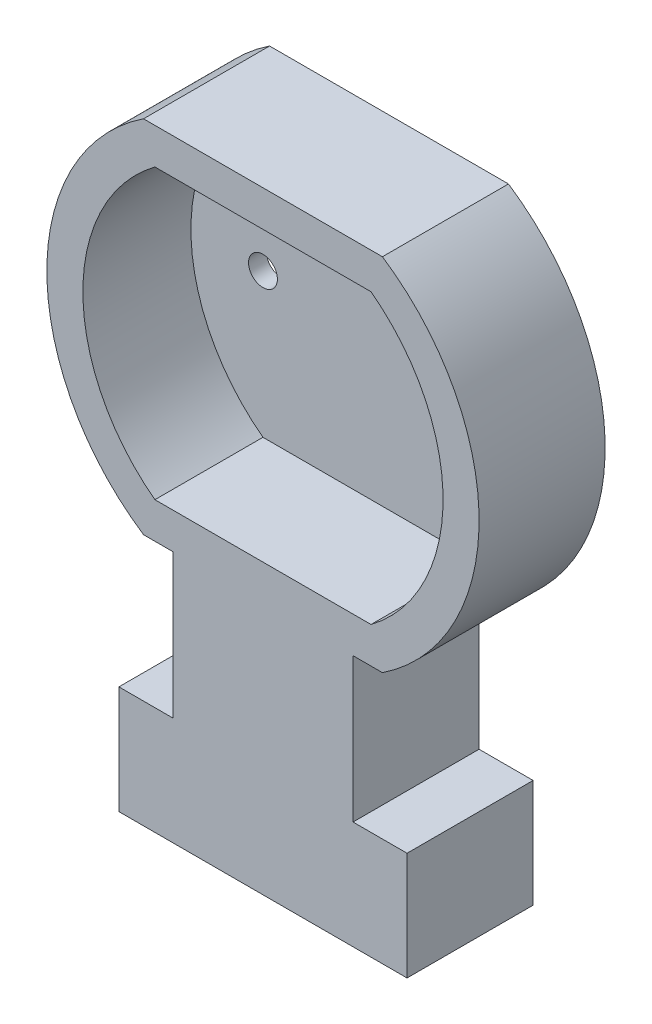
ISO-10303-21;
HEADER;
FILE_DESCRIPTION(('STEP AP214'),'2;1');
FILE_NAME('part.step','',(''),(''),'','','');
FILE_SCHEMA(('AUTOMOTIVE_DESIGN { 1 0 10303 214 1 1 1 1 }'));
ENDSEC;
DATA;
#1=APPLICATION_CONTEXT('core data for automotive mechanical design processes');
#2=APPLICATION_PROTOCOL_DEFINITION('international standard','automotive_design',2000,#1);
#3=PRODUCT_CONTEXT('',#1,'mechanical');
#4=PRODUCT('Part','Part','',(#3));
#5=PRODUCT_RELATED_PRODUCT_CATEGORY('part','',(#4));
#6=PRODUCT_DEFINITION_FORMATION('','',#4);
#7=PRODUCT_DEFINITION_CONTEXT('part definition',#1,'design');
#8=PRODUCT_DEFINITION('design','',#6,#7);
#9=PRODUCT_DEFINITION_SHAPE('','',#8);
#10=(LENGTH_UNIT() NAMED_UNIT(*) SI_UNIT(.MILLI.,.METRE.));
#11=(NAMED_UNIT(*) PLANE_ANGLE_UNIT() SI_UNIT($,.RADIAN.));
#12=(NAMED_UNIT(*) SI_UNIT($,.STERADIAN.) SOLID_ANGLE_UNIT());
#13=UNCERTAINTY_MEASURE_WITH_UNIT(LENGTH_MEASURE(1.E-05),#10,'distance_accuracy_value','');
#14=(GEOMETRIC_REPRESENTATION_CONTEXT(3) GLOBAL_UNCERTAINTY_ASSIGNED_CONTEXT((#13)) GLOBAL_UNIT_ASSIGNED_CONTEXT((#10,
#11,#12)) REPRESENTATION_CONTEXT('',''));
#15=CARTESIAN_POINT('',(0.,0.,0.));
#16=DIRECTION('',(0.,0.,1.));
#17=DIRECTION('',(1.,0.,0.));
#18=AXIS2_PLACEMENT_3D('',#15,#16,#17);
#19=CARTESIAN_POINT('',(-3.3166247903554,-5.,-0.5));
#20=DIRECTION('',(0.,-1.,0.));
#21=DIRECTION('',(1.,0.,0.));
#22=AXIS2_PLACEMENT_3D('',#19,#20,#21);
#23=PLANE('',#22);
#24=DIRECTION('',(1.,0.,0.));
#25=VECTOR('',#24,1.);
#26=CARTESIAN_POINT('',(-3.3166247903554,-5.,-0.5));
#27=LINE('',#26,#25);
#28=CARTESIAN_POINT('',(-3.3166247903554,-5.,-0.5));
#29=VERTEX_POINT('',#28);
#30=CARTESIAN_POINT('',(-2.5,-5.,-0.5));
#31=VERTEX_POINT('',#30);
#32=EDGE_CURVE('E61',#29,#31,#27,.T.);
#33=ORIENTED_EDGE('',*,*,#32,.T.);
#34=DIRECTION('',(0.,0.,1.));
#35=VECTOR('',#34,1.);
#36=CARTESIAN_POINT('',(-2.5,-5.,-0.5));
#37=LINE('',#36,#35);
#38=CARTESIAN_POINT('',(-2.5,-5.,3.));
#39=VERTEX_POINT('',#38);
#40=EDGE_CURVE('E167',#31,#39,#37,.T.);
#41=ORIENTED_EDGE('',*,*,#40,.T.);
#42=DIRECTION('',(1.,0.,0.));
#43=VECTOR('',#42,1.);
#44=CARTESIAN_POINT('',(0.,-5.,3.));
#45=LINE('',#44,#43);
#46=CARTESIAN_POINT('',(-3.3166247903554,-5.,3.));
#47=VERTEX_POINT('',#46);
#48=EDGE_CURVE('E155',#47,#39,#45,.T.);
#49=ORIENTED_EDGE('',*,*,#48,.F.);
#50=DIRECTION('',(0.,0.,1.));
#51=VECTOR('',#50,1.);
#52=CARTESIAN_POINT('',(-3.3166247903554,-5.,-0.5));
#53=LINE('',#52,#51);
#54=EDGE_CURVE('E286',#29,#47,#53,.T.);
#55=ORIENTED_EDGE('',*,*,#54,.F.);
#56=EDGE_LOOP('',(#33,#41,#49,#55));
#57=FACE_BOUND('',#56,.T.);
#58=ADVANCED_FACE('F38',(#57),#23,.T.);
#59=CARTESIAN_POINT('',(0.,0.,-0.5));
#60=DIRECTION('',(0.,0.,1.));
#61=DIRECTION('',(1.,0.,0.));
#62=AXIS2_PLACEMENT_3D('',#59,#60,#61);
#63=PLANE('',#62);
#64=DIRECTION('',(1.,0.,0.));
#65=VECTOR('',#64,1.);
#66=CARTESIAN_POINT('',(-3.3166247903554,5.,-0.5));
#67=LINE('',#66,#65);
#68=CARTESIAN_POINT('',(-3.3166247903554,5.,-0.5));
#69=VERTEX_POINT('',#68);
#70=CARTESIAN_POINT('',(3.3166247903554,5.,-0.5));
#71=VERTEX_POINT('',#70);
#72=EDGE_CURVE('E274',#69,#71,#67,.T.);
#73=ORIENTED_EDGE('',*,*,#72,.T.);
#74=CARTESIAN_POINT('',(0.,0.,-0.5));
#75=DIRECTION('',(0.,0.,1.));
#76=DIRECTION('',(1.,0.,0.));
#77=AXIS2_PLACEMENT_3D('',#74,#75,#76);
#78=CIRCLE('',#77,6.);
#79=CARTESIAN_POINT('',(3.3166247903554,-5.,-0.5));
#80=VERTEX_POINT('',#79);
#81=EDGE_CURVE('E276',#80,#71,#78,.T.);
#82=ORIENTED_EDGE('',*,*,#81,.F.);
#83=CARTESIAN_POINT('',(2.5,-5.,-0.5));
#84=VERTEX_POINT('',#83);
#85=EDGE_CURVE('E279',#84,#80,#27,.T.);
#86=ORIENTED_EDGE('',*,*,#85,.F.);
#87=DIRECTION('',(0.,-1.,0.));
#88=VECTOR('',#87,1.);
#89=CARTESIAN_POINT('',(2.5,0.,-0.5));
#90=LINE('',#89,#88);
#91=CARTESIAN_POINT('',(2.5,-9.,-0.5));
#92=VERTEX_POINT('',#91);
#93=EDGE_CURVE('E166',#84,#92,#90,.T.);
#94=ORIENTED_EDGE('',*,*,#93,.T.);
#95=DIRECTION('',(1.,0.,0.));
#96=VECTOR('',#95,1.);
#97=CARTESIAN_POINT('',(0.,-9.,-0.5));
#98=LINE('',#97,#96);
#99=CARTESIAN_POINT('',(4.,-9.,-0.5));
#100=VERTEX_POINT('',#99);
#101=EDGE_CURVE('E168',#92,#100,#98,.T.);
#102=ORIENTED_EDGE('',*,*,#101,.T.);
#103=DIRECTION('',(0.,-1.,0.));
#104=VECTOR('',#103,1.);
#105=CARTESIAN_POINT('',(4.,0.,-0.5));
#106=LINE('',#105,#104);
#107=CARTESIAN_POINT('',(4.,-12.,-0.5));
#108=VERTEX_POINT('',#107);
#109=EDGE_CURVE('E206',#100,#108,#106,.T.);
#110=ORIENTED_EDGE('',*,*,#109,.T.);
#111=DIRECTION('',(1.,0.,0.));
#112=VECTOR('',#111,1.);
#113=CARTESIAN_POINT('',(0.,-12.,-0.5));
#114=LINE('',#113,#112);
#115=CARTESIAN_POINT('',(-4.,-12.,-0.5));
#116=VERTEX_POINT('',#115);
#117=EDGE_CURVE('E203',#116,#108,#114,.T.);
#118=ORIENTED_EDGE('',*,*,#117,.F.);
#119=DIRECTION('',(0.,-1.,0.));
#120=VECTOR('',#119,1.);
#121=CARTESIAN_POINT('',(-4.,0.,-0.5));
#122=LINE('',#121,#120);
#123=CARTESIAN_POINT('',(-4.,-9.,-0.5));
#124=VERTEX_POINT('',#123);
#125=EDGE_CURVE('E200',#124,#116,#122,.T.);
#126=ORIENTED_EDGE('',*,*,#125,.F.);
#127=DIRECTION('',(-1.,0.,0.));
#128=VECTOR('',#127,1.);
#129=CARTESIAN_POINT('',(0.,-9.,-0.5));
#130=LINE('',#129,#128);
#131=CARTESIAN_POINT('',(-2.5,-9.,-0.5));
#132=VERTEX_POINT('',#131);
#133=EDGE_CURVE('E197',#132,#124,#130,.T.);
#134=ORIENTED_EDGE('',*,*,#133,.F.);
#135=DIRECTION('',(0.,-1.,0.));
#136=VECTOR('',#135,1.);
#137=CARTESIAN_POINT('',(-2.5,0.,-0.5));
#138=LINE('',#137,#136);
#139=EDGE_CURVE('E194',#31,#132,#138,.T.);
#140=ORIENTED_EDGE('',*,*,#139,.F.);
#141=ORIENTED_EDGE('',*,*,#32,.F.);
#142=CARTESIAN_POINT('',(0.,0.,-0.5));
#143=DIRECTION('',(0.,0.,1.));
#144=DIRECTION('',(1.,0.,0.));
#145=AXIS2_PLACEMENT_3D('',#142,#143,#144);
#146=CIRCLE('',#145,6.);
#147=EDGE_CURVE('E281',#69,#29,#146,.T.);
#148=ORIENTED_EDGE('',*,*,#147,.F.);
#149=EDGE_LOOP('',(#73,#82,#86,#94,#102,#110,#118,#126,#134,#140,#141,#148));
#150=FACE_BOUND('',#149,.T.);
#151=CARTESIAN_POINT('',(3.,0.,-0.5));
#152=DIRECTION('',(0.,0.,-1.));
#153=DIRECTION('',(-1.,0.,0.));
#154=AXIS2_PLACEMENT_3D('',#151,#152,#153);
#155=CIRCLE('',#154,0.4);
#156=CARTESIAN_POINT('',(2.6,0.,-0.5));
#157=VERTEX_POINT('',#156);
#158=EDGE_CURVE('E211',#157,#157,#155,.T.);
#159=ORIENTED_EDGE('',*,*,#158,.F.);
#160=EDGE_LOOP('',(#159));
#161=FACE_BOUND('',#160,.T.);
#162=CARTESIAN_POINT('',(-3.,0.,-0.5));
#163=DIRECTION('',(0.,0.,1.));
#164=DIRECTION('',(1.,0.,0.));
#165=AXIS2_PLACEMENT_3D('',#162,#163,#164);
#166=CIRCLE('',#165,0.4);
#167=CARTESIAN_POINT('',(-2.6,0.,-0.5));
#168=VERTEX_POINT('',#167);
#169=EDGE_CURVE('E223',#168,#168,#166,.T.);
#170=ORIENTED_EDGE('',*,*,#169,.T.);
#171=EDGE_LOOP('',(#170));
#172=FACE_BOUND('',#171,.T.);
#173=ADVANCED_FACE('F298',(#150,#161,#172),#63,.F.);
#174=CARTESIAN_POINT('',(0.,0.,0.));
#175=DIRECTION('',(0.,0.,1.));
#176=DIRECTION('',(1.,0.,0.));
#177=AXIS2_PLACEMENT_3D('',#174,#175,#176);
#178=PLANE('',#177);
#179=CARTESIAN_POINT('',(3.,0.,0.));
#180=DIRECTION('',(0.,0.,-1.));
#181=DIRECTION('',(-1.,0.,0.));
#182=AXIS2_PLACEMENT_3D('',#179,#180,#181);
#183=CIRCLE('',#182,0.4);
#184=CARTESIAN_POINT('',(2.6,0.,0.));
#185=VERTEX_POINT('',#184);
#186=EDGE_CURVE('E230',#185,#185,#183,.T.);
#187=ORIENTED_EDGE('',*,*,#186,.T.);
#188=EDGE_LOOP('',(#187));
#189=FACE_BOUND('',#188,.T.);
#190=CARTESIAN_POINT('',(0.,0.,0.));
#191=DIRECTION('',(0.,0.,1.));
#192=DIRECTION('',(1.,0.,0.));
#193=AXIS2_PLACEMENT_3D('',#190,#191,#192);
#194=CIRCLE('',#193,5.);
#195=CARTESIAN_POINT('',(3.,-4.,0.));
#196=VERTEX_POINT('',#195);
#197=CARTESIAN_POINT('',(3.,4.,0.));
#198=VERTEX_POINT('',#197);
#199=EDGE_CURVE('E226',#196,#198,#194,.T.);
#200=ORIENTED_EDGE('',*,*,#199,.T.);
#201=DIRECTION('',(1.,0.,0.));
#202=VECTOR('',#201,1.);
#203=CARTESIAN_POINT('',(0.,4.,0.));
#204=LINE('',#203,#202);
#205=CARTESIAN_POINT('',(-3.,4.,0.));
#206=VERTEX_POINT('',#205);
#207=EDGE_CURVE('E239',#206,#198,#204,.T.);
#208=ORIENTED_EDGE('',*,*,#207,.F.);
#209=CARTESIAN_POINT('',(0.,0.,0.));
#210=DIRECTION('',(0.,0.,1.));
#211=DIRECTION('',(1.,0.,0.));
#212=AXIS2_PLACEMENT_3D('',#209,#210,#211);
#213=CIRCLE('',#212,5.);
#214=CARTESIAN_POINT('',(-3.,-4.,0.));
#215=VERTEX_POINT('',#214);
#216=EDGE_CURVE('E261',#206,#215,#213,.T.);
#217=ORIENTED_EDGE('',*,*,#216,.T.);
#218=DIRECTION('',(1.,0.,0.));
#219=VECTOR('',#218,1.);
#220=CARTESIAN_POINT('',(0.,-4.,0.));
#221=LINE('',#220,#219);
#222=EDGE_CURVE('E258',#215,#196,#221,.T.);
#223=ORIENTED_EDGE('',*,*,#222,.T.);
#224=EDGE_LOOP('',(#200,#208,#217,#223));
#225=FACE_BOUND('',#224,.T.);
#226=CARTESIAN_POINT('',(-3.,0.,0.));
#227=DIRECTION('',(0.,0.,1.));
#228=DIRECTION('',(1.,0.,0.));
#229=AXIS2_PLACEMENT_3D('',#226,#227,#228);
#230=CIRCLE('',#229,0.4);
#231=CARTESIAN_POINT('',(-2.6,0.,0.));
#232=VERTEX_POINT('',#231);
#233=EDGE_CURVE('E227',#232,#232,#230,.T.);
#234=ORIENTED_EDGE('',*,*,#233,.F.);
#235=EDGE_LOOP('',(#234));
#236=FACE_BOUND('',#235,.T.);
#237=ADVANCED_FACE('F330',(#189,#225,#236),#178,.T.);
#238=CARTESIAN_POINT('',(-3.3166247903554,5.,-0.5));
#239=DIRECTION('',(0.,-1.,0.));
#240=DIRECTION('',(0.,0.,-1.));
#241=AXIS2_PLACEMENT_3D('',#238,#239,#240);
#242=PLANE('',#241);
#243=DIRECTION('',(0.,0.,1.));
#244=VECTOR('',#243,1.);
#245=CARTESIAN_POINT('',(-3.3166247903554,5.,-0.5));
#246=LINE('',#245,#244);
#247=CARTESIAN_POINT('',(-3.3166247903554,5.,3.));
#248=VERTEX_POINT('',#247);
#249=EDGE_CURVE('E284',#69,#248,#246,.T.);
#250=ORIENTED_EDGE('',*,*,#249,.T.);
#251=DIRECTION('',(1.,0.,0.));
#252=VECTOR('',#251,1.);
#253=CARTESIAN_POINT('',(0.,5.,3.));
#254=LINE('',#253,#252);
#255=CARTESIAN_POINT('',(3.3166247903554,5.,3.));
#256=VERTEX_POINT('',#255);
#257=EDGE_CURVE('E247',#248,#256,#254,.T.);
#258=ORIENTED_EDGE('',*,*,#257,.T.);
#259=DIRECTION('',(0.,0.,1.));
#260=VECTOR('',#259,1.);
#261=CARTESIAN_POINT('',(3.3166247903554,5.,-0.5));
#262=LINE('',#261,#260);
#263=EDGE_CURVE('E11',#71,#256,#262,.T.);
#264=ORIENTED_EDGE('',*,*,#263,.F.);
#265=ORIENTED_EDGE('',*,*,#72,.F.);
#266=EDGE_LOOP('',(#250,#258,#264,#265));
#267=FACE_BOUND('',#266,.T.);
#268=ADVANCED_FACE('F40',(#267),#242,.F.);
#269=CARTESIAN_POINT('',(0.,0.,-0.5));
#270=DIRECTION('',(0.,0.,1.));
#271=DIRECTION('',(1.,0.,0.));
#272=AXIS2_PLACEMENT_3D('',#269,#270,#271);
#273=CYLINDRICAL_SURFACE('',#272,6.);
#274=ORIENTED_EDGE('',*,*,#263,.T.);
#275=CARTESIAN_POINT('',(0.,0.,3.));
#276=DIRECTION('',(0.,0.,1.));
#277=DIRECTION('',(1.,0.,0.));
#278=AXIS2_PLACEMENT_3D('',#275,#276,#277);
#279=CIRCLE('',#278,6.);
#280=CARTESIAN_POINT('',(3.3166247903554,-5.,3.));
#281=VERTEX_POINT('',#280);
#282=EDGE_CURVE('E253',#281,#256,#279,.T.);
#283=ORIENTED_EDGE('',*,*,#282,.F.);
#284=DIRECTION('',(0.,0.,1.));
#285=VECTOR('',#284,1.);
#286=CARTESIAN_POINT('',(3.3166247903554,-5.,-0.5));
#287=LINE('',#286,#285);
#288=EDGE_CURVE('E46',#80,#281,#287,.T.);
#289=ORIENTED_EDGE('',*,*,#288,.F.);
#290=ORIENTED_EDGE('',*,*,#81,.T.);
#291=EDGE_LOOP('',(#274,#283,#289,#290));
#292=FACE_BOUND('',#291,.T.);
#293=ADVANCED_FACE('F323',(#292),#273,.T.);
#294=DIRECTION('',(0.,0.,1.));
#295=VECTOR('',#294,1.);
#296=CARTESIAN_POINT('',(2.5,-5.,-0.5));
#297=LINE('',#296,#295);
#298=CARTESIAN_POINT('',(2.5,-5.,3.));
#299=VERTEX_POINT('',#298);
#300=EDGE_CURVE('E53',#84,#299,#297,.T.);
#301=ORIENTED_EDGE('',*,*,#300,.F.);
#302=ORIENTED_EDGE('',*,*,#85,.T.);
#303=ORIENTED_EDGE('',*,*,#288,.T.);
#304=EDGE_CURVE('E148',#299,#281,#45,.T.);
#305=ORIENTED_EDGE('',*,*,#304,.F.);
#306=EDGE_LOOP('',(#301,#302,#303,#305));
#307=FACE_BOUND('',#306,.T.);
#308=ADVANCED_FACE('F149',(#307),#23,.T.);
#309=CARTESIAN_POINT('',(0.,0.,-0.5));
#310=DIRECTION('',(0.,0.,1.));
#311=DIRECTION('',(1.,0.,0.));
#312=AXIS2_PLACEMENT_3D('',#309,#310,#311);
#313=CYLINDRICAL_SURFACE('',#312,6.);
#314=ORIENTED_EDGE('',*,*,#54,.T.);
#315=CARTESIAN_POINT('',(0.,0.,3.));
#316=DIRECTION('',(0.,0.,1.));
#317=DIRECTION('',(1.,0.,0.));
#318=AXIS2_PLACEMENT_3D('',#315,#316,#317);
#319=CIRCLE('',#318,6.);
#320=EDGE_CURVE('E156',#248,#47,#319,.T.);
#321=ORIENTED_EDGE('',*,*,#320,.F.);
#322=ORIENTED_EDGE('',*,*,#249,.F.);
#323=ORIENTED_EDGE('',*,*,#147,.T.);
#324=EDGE_LOOP('',(#314,#321,#322,#323));
#325=FACE_BOUND('',#324,.T.);
#326=ADVANCED_FACE('F290',(#325),#313,.T.);
#327=CARTESIAN_POINT('',(0.,0.,3.));
#328=DIRECTION('',(0.,0.,-1.));
#329=DIRECTION('',(-1.,0.,0.));
#330=AXIS2_PLACEMENT_3D('',#327,#328,#329);
#331=CYLINDRICAL_SURFACE('',#330,5.);
#332=ORIENTED_EDGE('',*,*,#199,.F.);
#333=DIRECTION('',(0.,0.,-1.));
#334=VECTOR('',#333,1.);
#335=CARTESIAN_POINT('',(3.,-4.,3.));
#336=LINE('',#335,#334);
#337=CARTESIAN_POINT('',(3.,-4.,3.));
#338=VERTEX_POINT('',#337);
#339=EDGE_CURVE('E272',#338,#196,#336,.T.);
#340=ORIENTED_EDGE('',*,*,#339,.F.);
#341=CARTESIAN_POINT('',(0.,0.,3.));
#342=DIRECTION('',(0.,0.,1.));
#343=DIRECTION('',(1.,0.,0.));
#344=AXIS2_PLACEMENT_3D('',#341,#342,#343);
#345=CIRCLE('',#344,5.);
#346=CARTESIAN_POINT('',(3.,4.,3.));
#347=VERTEX_POINT('',#346);
#348=EDGE_CURVE('E235',#338,#347,#345,.T.);
#349=ORIENTED_EDGE('',*,*,#348,.T.);
#350=DIRECTION('',(0.,0.,-1.));
#351=VECTOR('',#350,1.);
#352=CARTESIAN_POINT('',(3.,4.,3.));
#353=LINE('',#352,#351);
#354=EDGE_CURVE('E255',#347,#198,#353,.T.);
#355=ORIENTED_EDGE('',*,*,#354,.T.);
#356=EDGE_LOOP('',(#332,#340,#349,#355));
#357=FACE_BOUND('',#356,.T.);
#358=ADVANCED_FACE('F339',(#357),#331,.F.);
#359=CARTESIAN_POINT('',(0.,-4.,3.));
#360=DIRECTION('',(0.,1.,0.));
#361=DIRECTION('',(-1.,0.,0.));
#362=AXIS2_PLACEMENT_3D('',#359,#360,#361);
#363=PLANE('',#362);
#364=ORIENTED_EDGE('',*,*,#222,.F.);
#365=DIRECTION('',(0.,0.,-1.));
#366=VECTOR('',#365,1.);
#367=CARTESIAN_POINT('',(-3.,-4.,3.));
#368=LINE('',#367,#366);
#369=CARTESIAN_POINT('',(-3.,-4.,3.));
#370=VERTEX_POINT('',#369);
#371=EDGE_CURVE('E270',#370,#215,#368,.T.);
#372=ORIENTED_EDGE('',*,*,#371,.F.);
#373=DIRECTION('',(1.,0.,0.));
#374=VECTOR('',#373,1.);
#375=CARTESIAN_POINT('',(0.,-4.,3.));
#376=LINE('',#375,#374);
#377=EDGE_CURVE('E238',#370,#338,#376,.T.);
#378=ORIENTED_EDGE('',*,*,#377,.T.);
#379=ORIENTED_EDGE('',*,*,#339,.T.);
#380=EDGE_LOOP('',(#364,#372,#378,#379));
#381=FACE_BOUND('',#380,.T.);
#382=ADVANCED_FACE('F345',(#381),#363,.T.);
#383=CARTESIAN_POINT('',(0.,0.,3.));
#384=DIRECTION('',(0.,0.,-1.));
#385=DIRECTION('',(-1.,0.,0.));
#386=AXIS2_PLACEMENT_3D('',#383,#384,#385);
#387=CYLINDRICAL_SURFACE('',#386,5.);
#388=ORIENTED_EDGE('',*,*,#216,.F.);
#389=DIRECTION('',(0.,0.,-1.));
#390=VECTOR('',#389,1.);
#391=CARTESIAN_POINT('',(-3.,4.,3.));
#392=LINE('',#391,#390);
#393=CARTESIAN_POINT('',(-3.,4.,3.));
#394=VERTEX_POINT('',#393);
#395=EDGE_CURVE('E267',#394,#206,#392,.T.);
#396=ORIENTED_EDGE('',*,*,#395,.F.);
#397=CARTESIAN_POINT('',(0.,0.,3.));
#398=DIRECTION('',(0.,0.,1.));
#399=DIRECTION('',(1.,0.,0.));
#400=AXIS2_PLACEMENT_3D('',#397,#398,#399);
#401=CIRCLE('',#400,5.);
#402=EDGE_CURVE('E242',#394,#370,#401,.T.);
#403=ORIENTED_EDGE('',*,*,#402,.T.);
#404=ORIENTED_EDGE('',*,*,#371,.T.);
#405=EDGE_LOOP('',(#388,#396,#403,#404));
#406=FACE_BOUND('',#405,.T.);
#407=ADVANCED_FACE('F349',(#406),#387,.F.);
#408=CARTESIAN_POINT('',(0.,4.,3.));
#409=DIRECTION('',(0.,1.,0.));
#410=DIRECTION('',(-1.,0.,0.));
#411=AXIS2_PLACEMENT_3D('',#408,#409,#410);
#412=PLANE('',#411);
#413=ORIENTED_EDGE('',*,*,#207,.T.);
#414=ORIENTED_EDGE('',*,*,#354,.F.);
#415=DIRECTION('',(1.,0.,0.));
#416=VECTOR('',#415,1.);
#417=CARTESIAN_POINT('',(0.,4.,3.));
#418=LINE('',#417,#416);
#419=EDGE_CURVE('E245',#394,#347,#418,.T.);
#420=ORIENTED_EDGE('',*,*,#419,.F.);
#421=ORIENTED_EDGE('',*,*,#395,.T.);
#422=EDGE_LOOP('',(#413,#414,#420,#421));
#423=FACE_BOUND('',#422,.T.);
#424=ADVANCED_FACE('F353',(#423),#412,.F.);
#425=CARTESIAN_POINT('',(0.,0.,3.));
#426=DIRECTION('',(0.,0.,1.));
#427=DIRECTION('',(1.,0.,0.));
#428=AXIS2_PLACEMENT_3D('',#425,#426,#427);
#429=PLANE('',#428);
#430=ORIENTED_EDGE('',*,*,#348,.F.);
#431=ORIENTED_EDGE('',*,*,#377,.F.);
#432=ORIENTED_EDGE('',*,*,#402,.F.);
#433=ORIENTED_EDGE('',*,*,#419,.T.);
#434=EDGE_LOOP('',(#430,#431,#432,#433));
#435=FACE_BOUND('',#434,.T.);
#436=ORIENTED_EDGE('',*,*,#257,.F.);
#437=ORIENTED_EDGE('',*,*,#320,.T.);
#438=ORIENTED_EDGE('',*,*,#48,.T.);
#439=DIRECTION('',(0.,-1.,0.));
#440=VECTOR('',#439,1.);
#441=CARTESIAN_POINT('',(-2.5,0.,3.));
#442=LINE('',#441,#440);
#443=CARTESIAN_POINT('',(-2.5,-9.,3.));
#444=VERTEX_POINT('',#443);
#445=EDGE_CURVE('E175',#39,#444,#442,.T.);
#446=ORIENTED_EDGE('',*,*,#445,.T.);
#447=DIRECTION('',(-1.,0.,0.));
#448=VECTOR('',#447,1.);
#449=CARTESIAN_POINT('',(0.,-9.,3.));
#450=LINE('',#449,#448);
#451=CARTESIAN_POINT('',(-4.,-9.,3.));
#452=VERTEX_POINT('',#451);
#453=EDGE_CURVE('E178',#444,#452,#450,.T.);
#454=ORIENTED_EDGE('',*,*,#453,.T.);
#455=DIRECTION('',(0.,-1.,0.));
#456=VECTOR('',#455,1.);
#457=CARTESIAN_POINT('',(-4.,0.,3.));
#458=LINE('',#457,#456);
#459=CARTESIAN_POINT('',(-4.,-12.,3.));
#460=VERTEX_POINT('',#459);
#461=EDGE_CURVE('E183',#452,#460,#458,.T.);
#462=ORIENTED_EDGE('',*,*,#461,.T.);
#463=DIRECTION('',(1.,0.,0.));
#464=VECTOR('',#463,1.);
#465=CARTESIAN_POINT('',(0.,-12.,3.));
#466=LINE('',#465,#464);
#467=CARTESIAN_POINT('',(4.,-12.,3.));
#468=VERTEX_POINT('',#467);
#469=EDGE_CURVE('E186',#460,#468,#466,.T.);
#470=ORIENTED_EDGE('',*,*,#469,.T.);
#471=DIRECTION('',(0.,-1.,0.));
#472=VECTOR('',#471,1.);
#473=CARTESIAN_POINT('',(4.,0.,3.));
#474=LINE('',#473,#472);
#475=CARTESIAN_POINT('',(4.,-9.,3.));
#476=VERTEX_POINT('',#475);
#477=EDGE_CURVE('E189',#476,#468,#474,.T.);
#478=ORIENTED_EDGE('',*,*,#477,.F.);
#479=DIRECTION('',(1.,0.,0.));
#480=VECTOR('',#479,1.);
#481=CARTESIAN_POINT('',(0.,-9.,3.));
#482=LINE('',#481,#480);
#483=CARTESIAN_POINT('',(2.5,-9.,3.));
#484=VERTEX_POINT('',#483);
#485=EDGE_CURVE('E174',#484,#476,#482,.T.);
#486=ORIENTED_EDGE('',*,*,#485,.F.);
#487=DIRECTION('',(0.,-1.,0.));
#488=VECTOR('',#487,1.);
#489=CARTESIAN_POINT('',(2.5,0.,3.));
#490=LINE('',#489,#488);
#491=EDGE_CURVE('E163',#299,#484,#490,.T.);
#492=ORIENTED_EDGE('',*,*,#491,.F.);
#493=ORIENTED_EDGE('',*,*,#304,.T.);
#494=ORIENTED_EDGE('',*,*,#282,.T.);
#495=EDGE_LOOP('',(#436,#437,#438,#446,#454,#462,#470,#478,#486,#492,#493,#494));
#496=FACE_BOUND('',#495,.T.);
#497=ADVANCED_FACE('F171',(#435,#496),#429,.T.);
#498=CARTESIAN_POINT('',(3.,0.,-0.5));
#499=DIRECTION('',(0.,0.,1.));
#500=DIRECTION('',(1.,0.,0.));
#501=AXIS2_PLACEMENT_3D('',#498,#499,#500);
#502=CYLINDRICAL_SURFACE('',#501,0.4);
#503=ORIENTED_EDGE('',*,*,#158,.T.);
#504=EDGE_LOOP('',(#503));
#505=FACE_BOUND('',#504,.T.);
#506=ORIENTED_EDGE('',*,*,#186,.F.);
#507=EDGE_LOOP('',(#506));
#508=FACE_BOUND('',#507,.T.);
#509=ADVANCED_FACE('F360',(#505,#508),#502,.F.);
#510=CARTESIAN_POINT('',(-3.,0.,-0.5));
#511=DIRECTION('',(0.,0.,1.));
#512=DIRECTION('',(1.,0.,0.));
#513=AXIS2_PLACEMENT_3D('',#510,#511,#512);
#514=CYLINDRICAL_SURFACE('',#513,0.4);
#515=ORIENTED_EDGE('',*,*,#169,.F.);
#516=EDGE_LOOP('',(#515));
#517=FACE_BOUND('',#516,.T.);
#518=ORIENTED_EDGE('',*,*,#233,.T.);
#519=EDGE_LOOP('',(#518));
#520=FACE_BOUND('',#519,.T.);
#521=ADVANCED_FACE('F364',(#517,#520),#514,.F.);
#522=CARTESIAN_POINT('',(2.5,0.,-0.5));
#523=DIRECTION('',(-1.,0.,0.));
#524=DIRECTION('',(0.,-1.,0.));
#525=AXIS2_PLACEMENT_3D('',#522,#523,#524);
#526=PLANE('',#525);
#527=ORIENTED_EDGE('',*,*,#300,.T.);
#528=ORIENTED_EDGE('',*,*,#491,.T.);
#529=DIRECTION('',(0.,0.,1.));
#530=VECTOR('',#529,1.);
#531=CARTESIAN_POINT('',(2.5,-9.,-0.5));
#532=LINE('',#531,#530);
#533=EDGE_CURVE('E209',#92,#484,#532,.T.);
#534=ORIENTED_EDGE('',*,*,#533,.F.);
#535=ORIENTED_EDGE('',*,*,#93,.F.);
#536=EDGE_LOOP('',(#527,#528,#534,#535));
#537=FACE_BOUND('',#536,.T.);
#538=ADVANCED_FACE('F161',(#537),#526,.F.);
#539=CARTESIAN_POINT('',(0.,-9.,-0.5));
#540=DIRECTION('',(0.,-1.,0.));
#541=DIRECTION('',(1.,0.,0.));
#542=AXIS2_PLACEMENT_3D('',#539,#540,#541);
#543=PLANE('',#542);
#544=ORIENTED_EDGE('',*,*,#533,.T.);
#545=ORIENTED_EDGE('',*,*,#485,.T.);
#546=DIRECTION('',(0.,0.,1.));
#547=VECTOR('',#546,1.);
#548=CARTESIAN_POINT('',(4.,-9.,-0.5));
#549=LINE('',#548,#547);
#550=EDGE_CURVE('E212',#100,#476,#549,.T.);
#551=ORIENTED_EDGE('',*,*,#550,.F.);
#552=ORIENTED_EDGE('',*,*,#101,.F.);
#553=EDGE_LOOP('',(#544,#545,#551,#552));
#554=FACE_BOUND('',#553,.T.);
#555=ADVANCED_FACE('F321',(#554),#543,.F.);
#556=CARTESIAN_POINT('',(4.,0.,-0.5));
#557=DIRECTION('',(-1.,0.,0.));
#558=DIRECTION('',(0.,0.,1.));
#559=AXIS2_PLACEMENT_3D('',#556,#557,#558);
#560=PLANE('',#559);
#561=ORIENTED_EDGE('',*,*,#550,.T.);
#562=ORIENTED_EDGE('',*,*,#477,.T.);
#563=DIRECTION('',(0.,0.,1.));
#564=VECTOR('',#563,1.);
#565=CARTESIAN_POINT('',(4.,-12.,-0.5));
#566=LINE('',#565,#564);
#567=EDGE_CURVE('E214',#108,#468,#566,.T.);
#568=ORIENTED_EDGE('',*,*,#567,.F.);
#569=ORIENTED_EDGE('',*,*,#109,.F.);
#570=EDGE_LOOP('',(#561,#562,#568,#569));
#571=FACE_BOUND('',#570,.T.);
#572=ADVANCED_FACE('F318',(#571),#560,.F.);
#573=CARTESIAN_POINT('',(0.,-12.,-0.5));
#574=DIRECTION('',(0.,-1.,0.));
#575=DIRECTION('',(1.,0.,0.));
#576=AXIS2_PLACEMENT_3D('',#573,#574,#575);
#577=PLANE('',#576);
#578=ORIENTED_EDGE('',*,*,#567,.T.);
#579=ORIENTED_EDGE('',*,*,#469,.F.);
#580=DIRECTION('',(0.,0.,1.));
#581=VECTOR('',#580,1.);
#582=CARTESIAN_POINT('',(-4.,-12.,-0.5));
#583=LINE('',#582,#581);
#584=EDGE_CURVE('E216',#116,#460,#583,.T.);
#585=ORIENTED_EDGE('',*,*,#584,.F.);
#586=ORIENTED_EDGE('',*,*,#117,.T.);
#587=EDGE_LOOP('',(#578,#579,#585,#586));
#588=FACE_BOUND('',#587,.T.);
#589=ADVANCED_FACE('F315',(#588),#577,.T.);
#590=CARTESIAN_POINT('',(-4.,0.,-0.5));
#591=DIRECTION('',(-1.,0.,0.));
#592=DIRECTION('',(0.,0.,1.));
#593=AXIS2_PLACEMENT_3D('',#590,#591,#592);
#594=PLANE('',#593);
#595=ORIENTED_EDGE('',*,*,#584,.T.);
#596=ORIENTED_EDGE('',*,*,#461,.F.);
#597=DIRECTION('',(0.,0.,1.));
#598=VECTOR('',#597,1.);
#599=CARTESIAN_POINT('',(-4.,-9.,-0.5));
#600=LINE('',#599,#598);
#601=EDGE_CURVE('E218',#124,#452,#600,.T.);
#602=ORIENTED_EDGE('',*,*,#601,.F.);
#603=ORIENTED_EDGE('',*,*,#125,.T.);
#604=EDGE_LOOP('',(#595,#596,#602,#603));
#605=FACE_BOUND('',#604,.T.);
#606=ADVANCED_FACE('F310',(#605),#594,.T.);
#607=CARTESIAN_POINT('',(0.,-9.,-0.5));
#608=DIRECTION('',(0.,1.,0.));
#609=DIRECTION('',(0.,0.,1.));
#610=AXIS2_PLACEMENT_3D('',#607,#608,#609);
#611=PLANE('',#610);
#612=ORIENTED_EDGE('',*,*,#601,.T.);
#613=ORIENTED_EDGE('',*,*,#453,.F.);
#614=DIRECTION('',(0.,0.,1.));
#615=VECTOR('',#614,1.);
#616=CARTESIAN_POINT('',(-2.5,-9.,-0.5));
#617=LINE('',#616,#615);
#618=EDGE_CURVE('E220',#132,#444,#617,.T.);
#619=ORIENTED_EDGE('',*,*,#618,.F.);
#620=ORIENTED_EDGE('',*,*,#133,.T.);
#621=EDGE_LOOP('',(#612,#613,#619,#620));
#622=FACE_BOUND('',#621,.T.);
#623=ADVANCED_FACE('F308',(#622),#611,.T.);
#624=CARTESIAN_POINT('',(-2.5,0.,-0.5));
#625=DIRECTION('',(-1.,0.,0.));
#626=DIRECTION('',(0.,-1.,0.));
#627=AXIS2_PLACEMENT_3D('',#624,#625,#626);
#628=PLANE('',#627);
#629=ORIENTED_EDGE('',*,*,#618,.T.);
#630=ORIENTED_EDGE('',*,*,#445,.F.);
#631=ORIENTED_EDGE('',*,*,#40,.F.);
#632=ORIENTED_EDGE('',*,*,#139,.T.);
#633=EDGE_LOOP('',(#629,#630,#631,#632));
#634=FACE_BOUND('',#633,.T.);
#635=ADVANCED_FACE('F304',(#634),#628,.T.);
#636=CLOSED_SHELL('',(#58,#173,#237,#268,#293,#308,#326,#358,#382,#407,#424,#497,#509,#521,#538,
#555,#572,#589,#606,#623,#635));
#637=MANIFOLD_SOLID_BREP('B2',#636);
#638=ADVANCED_BREP_SHAPE_REPRESENTATION('',(#18,#637),#14);
#639=SHAPE_DEFINITION_REPRESENTATION(#9,#638);
ENDSEC;
END-ISO-10303-21;
